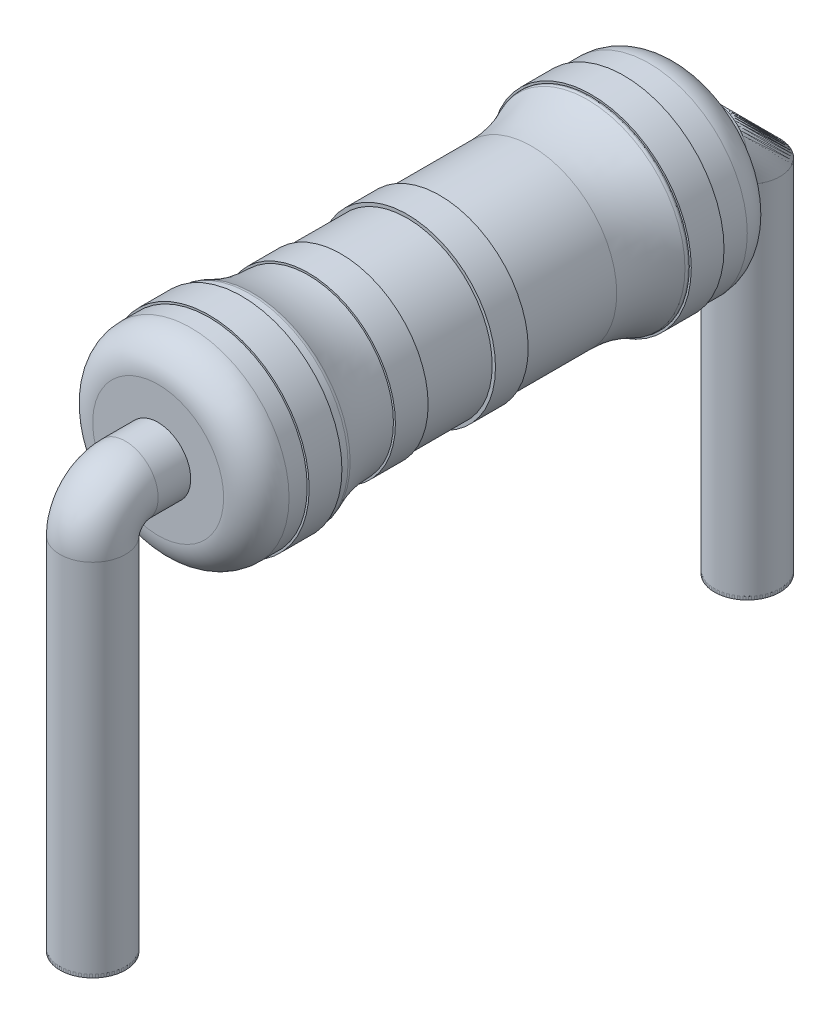
ISO-10303-21;
HEADER;
FILE_DESCRIPTION(('STEP AP214'),'2;1');
FILE_NAME('part.step','',(''),(''),'','','');
FILE_SCHEMA(('AUTOMOTIVE_DESIGN { 1 0 10303 214 1 1 1 1 }'));
ENDSEC;
DATA;
#1=APPLICATION_CONTEXT('core data for automotive mechanical design processes');
#2=APPLICATION_PROTOCOL_DEFINITION('international standard','automotive_design',2000,#1);
#3=PRODUCT_CONTEXT('',#1,'mechanical');
#4=PRODUCT('Part','Part','',(#3));
#5=PRODUCT_RELATED_PRODUCT_CATEGORY('part','',(#4));
#6=PRODUCT_DEFINITION_FORMATION('','',#4);
#7=PRODUCT_DEFINITION_CONTEXT('part definition',#1,'design');
#8=PRODUCT_DEFINITION('design','',#6,#7);
#9=PRODUCT_DEFINITION_SHAPE('','',#8);
#10=(LENGTH_UNIT() NAMED_UNIT(*) SI_UNIT(.MILLI.,.METRE.));
#11=(NAMED_UNIT(*) PLANE_ANGLE_UNIT() SI_UNIT($,.RADIAN.));
#12=(NAMED_UNIT(*) SI_UNIT($,.STERADIAN.) SOLID_ANGLE_UNIT());
#13=UNCERTAINTY_MEASURE_WITH_UNIT(LENGTH_MEASURE(1.E-05),#10,'distance_accuracy_value','');
#14=(GEOMETRIC_REPRESENTATION_CONTEXT(3) GLOBAL_UNCERTAINTY_ASSIGNED_CONTEXT((#13)) GLOBAL_UNIT_ASSIGNED_CONTEXT((#10,
#11,#12)) REPRESENTATION_CONTEXT('',''));
#15=CARTESIAN_POINT('',(0.,0.,0.));
#16=DIRECTION('',(0.,0.,1.));
#17=DIRECTION('',(1.,0.,0.));
#18=AXIS2_PLACEMENT_3D('',#15,#16,#17);
#19=CARTESIAN_POINT('',(0.,-5.95,-5.));
#20=DIRECTION('',(0.,-1.,0.));
#21=DIRECTION('',(0.,0.,-1.));
#22=AXIS2_PLACEMENT_3D('',#19,#20,#21);
#23=CYLINDRICAL_SURFACE('',#22,0.5);
#24=CARTESIAN_POINT('',(0.,-5.95,-5.));
#25=DIRECTION('',(0.,1.,0.));
#26=DIRECTION('',(0.,0.,1.));
#27=AXIS2_PLACEMENT_3D('',#24,#25,#26);
#28=CIRCLE('',#27,0.5);
#29=CARTESIAN_POINT('',(0.,-5.95,-4.5));
#30=VERTEX_POINT('',#29);
#31=EDGE_CURVE('E11',#30,#30,#28,.T.);
#32=ORIENTED_EDGE('',*,*,#31,.F.);
#33=EDGE_LOOP('',(#32));
#34=FACE_BOUND('',#33,.T.);
#35=CARTESIAN_POINT('',(0.,-6.,-5.));
#36=DIRECTION('',(0.,1.,0.));
#37=DIRECTION('',(0.,0.,1.));
#38=AXIS2_PLACEMENT_3D('',#35,#36,#37);
#39=CIRCLE('',#38,0.5);
#40=CARTESIAN_POINT('',(0.,-6.,-4.5));
#41=VERTEX_POINT('',#40);
#42=EDGE_CURVE('E47',#41,#41,#39,.T.);
#43=ORIENTED_EDGE('',*,*,#42,.T.);
#44=EDGE_LOOP('',(#43));
#45=FACE_BOUND('',#44,.T.);
#46=ADVANCED_FACE('F44',(#34,#45),#23,.T.);
#47=CARTESIAN_POINT('',(0.,-5.95,0.));
#48=DIRECTION('',(0.,1.,0.));
#49=DIRECTION('',(0.,0.,1.));
#50=AXIS2_PLACEMENT_3D('',#47,#48,#49);
#51=PLANE('',#50);
#52=ORIENTED_EDGE('',*,*,#31,.T.);
#53=EDGE_LOOP('',(#52));
#54=FACE_BOUND('',#53,.T.);
#55=ADVANCED_FACE('F59',(#54),#51,.T.);
#56=CARTESIAN_POINT('',(0.,-6.,0.));
#57=DIRECTION('',(0.,1.,0.));
#58=DIRECTION('',(0.,0.,1.));
#59=AXIS2_PLACEMENT_3D('',#56,#57,#58);
#60=PLANE('',#59);
#61=ORIENTED_EDGE('',*,*,#42,.F.);
#62=EDGE_LOOP('',(#61));
#63=FACE_BOUND('',#62,.T.);
#64=ADVANCED_FACE('F57',(#63),#60,.F.);
#65=CLOSED_SHELL('',(#46,#55,#64));
#66=MANIFOLD_SOLID_BREP('B2',#65);
#67=CARTESIAN_POINT('',(0.,-5.95,5.));
#68=DIRECTION('',(0.,-1.,0.));
#69=DIRECTION('',(0.,0.,-1.));
#70=AXIS2_PLACEMENT_3D('',#67,#68,#69);
#71=CYLINDRICAL_SURFACE('',#70,0.5);
#72=CARTESIAN_POINT('',(0.,-5.95,5.));
#73=DIRECTION('',(0.,1.,0.));
#74=DIRECTION('',(0.,0.,1.));
#75=AXIS2_PLACEMENT_3D('',#72,#73,#74);
#76=CIRCLE('',#75,0.5);
#77=CARTESIAN_POINT('',(0.,-5.95,5.5));
#78=VERTEX_POINT('',#77);
#79=EDGE_CURVE('E43',#78,#78,#76,.T.);
#80=ORIENTED_EDGE('',*,*,#79,.F.);
#81=EDGE_LOOP('',(#80));
#82=FACE_BOUND('',#81,.T.);
#83=CARTESIAN_POINT('',(0.,-6.,5.));
#84=DIRECTION('',(0.,1.,0.));
#85=DIRECTION('',(0.,0.,1.));
#86=AXIS2_PLACEMENT_3D('',#83,#84,#85);
#87=CIRCLE('',#86,0.5);
#88=CARTESIAN_POINT('',(0.,-6.,5.5));
#89=VERTEX_POINT('',#88);
#90=EDGE_CURVE('E101',#89,#89,#87,.T.);
#91=ORIENTED_EDGE('',*,*,#90,.T.);
#92=EDGE_LOOP('',(#91));
#93=FACE_BOUND('',#92,.T.);
#94=ADVANCED_FACE('F98',(#82,#93),#71,.T.);
#95=CARTESIAN_POINT('',(0.,-5.95,0.));
#96=DIRECTION('',(0.,1.,0.));
#97=DIRECTION('',(0.,0.,1.));
#98=AXIS2_PLACEMENT_3D('',#95,#96,#97);
#99=PLANE('',#98);
#100=ORIENTED_EDGE('',*,*,#79,.T.);
#101=EDGE_LOOP('',(#100));
#102=FACE_BOUND('',#101,.T.);
#103=ADVANCED_FACE('F113',(#102),#99,.T.);
#104=CARTESIAN_POINT('',(0.,-6.,0.));
#105=DIRECTION('',(0.,1.,0.));
#106=DIRECTION('',(0.,0.,1.));
#107=AXIS2_PLACEMENT_3D('',#104,#105,#106);
#108=PLANE('',#107);
#109=ORIENTED_EDGE('',*,*,#90,.F.);
#110=EDGE_LOOP('',(#109));
#111=FACE_BOUND('',#110,.T.);
#112=ADVANCED_FACE('F111',(#111),#108,.F.);
#113=CLOSED_SHELL('',(#94,#103,#112));
#114=MANIFOLD_SOLID_BREP('B6',#113);
#115=CARTESIAN_POINT('',(0.,0.,-4.));
#116=DIRECTION('',(0.,0.,-1.));
#117=DIRECTION('',(-1.,0.,0.));
#118=AXIS2_PLACEMENT_3D('',#115,#116,#117);
#119=CYLINDRICAL_SURFACE('',#118,0.5);
#120=CARTESIAN_POINT('',(0.,0.,-4.));
#121=DIRECTION('',(0.,0.,-1.));
#122=DIRECTION('',(-1.,0.,0.));
#123=AXIS2_PLACEMENT_3D('',#120,#121,#122);
#124=CIRCLE('',#123,0.5);
#125=CARTESIAN_POINT('',(-0.5,0.,-4.));
#126=VERTEX_POINT('',#125);
#127=EDGE_CURVE('E158',#126,#126,#124,.T.);
#128=ORIENTED_EDGE('',*,*,#127,.T.);
#129=EDGE_LOOP('',(#128));
#130=FACE_BOUND('',#129,.T.);
#131=CARTESIAN_POINT('',(0.,0.,-4.5));
#132=DIRECTION('',(0.,0.,-1.));
#133=DIRECTION('',(-1.,0.,0.));
#134=AXIS2_PLACEMENT_3D('',#131,#132,#133);
#135=CIRCLE('',#134,0.5);
#136=CARTESIAN_POINT('',(0.,-0.5,-4.5));
#137=VERTEX_POINT('',#136);
#138=EDGE_CURVE('E96',#137,#137,#135,.T.);
#139=ORIENTED_EDGE('',*,*,#138,.F.);
#140=EDGE_LOOP('',(#139));
#141=FACE_BOUND('',#140,.T.);
#142=ADVANCED_FACE('F152',(#130,#141),#119,.T.);
#143=CARTESIAN_POINT('',(0.,-0.5,-4.5));
#144=DIRECTION('',(-1.,0.,0.));
#145=DIRECTION('',(0.,0.,1.));
#146=AXIS2_PLACEMENT_3D('',#143,#144,#145);
#147=DEGENERATE_TOROIDAL_SURFACE('',#146,0.5,0.5,.T.);
#148=CARTESIAN_POINT('',(0.,-0.5,-5.));
#149=DIRECTION('',(0.,-1.,0.));
#150=DIRECTION('',(-1.,0.,0.));
#151=AXIS2_PLACEMENT_3D('',#148,#149,#150);
#152=CIRCLE('',#151,0.5);
#153=EDGE_CURVE('E163',#137,#137,#152,.T.);
#154=ORIENTED_EDGE('',*,*,#153,.F.);
#155=ORIENTED_EDGE('',*,*,#138,.T.);
#156=EDGE_LOOP('',(#154,#155));
#157=FACE_BOUND('',#156,.T.);
#158=ADVANCED_FACE('F175',(#157),#147,.T.);
#159=CARTESIAN_POINT('',(0.,-0.5,-5.));
#160=DIRECTION('',(0.,-1.,0.));
#161=DIRECTION('',(0.,0.,-1.));
#162=AXIS2_PLACEMENT_3D('',#159,#160,#161);
#163=CYLINDRICAL_SURFACE('',#162,0.5);
#164=ORIENTED_EDGE('',*,*,#153,.T.);
#165=EDGE_LOOP('',(#164));
#166=FACE_BOUND('',#165,.T.);
#167=CARTESIAN_POINT('',(0.,-6.,-5.));
#168=DIRECTION('',(0.,-1.,0.));
#169=DIRECTION('',(-1.,0.,0.));
#170=AXIS2_PLACEMENT_3D('',#167,#168,#169);
#171=CIRCLE('',#170,0.5);
#172=CARTESIAN_POINT('',(-0.5,-6.,-5.));
#173=VERTEX_POINT('',#172);
#174=EDGE_CURVE('E155',#173,#173,#171,.T.);
#175=ORIENTED_EDGE('',*,*,#174,.F.);
#176=EDGE_LOOP('',(#175));
#177=FACE_BOUND('',#176,.T.);
#178=ADVANCED_FACE('F153',(#166,#177),#163,.T.);
#179=OPEN_SHELL('',(#142,#158,#178));
#180=SHELL_BASED_SURFACE_MODEL('B38',(#179));
#181=CARTESIAN_POINT('',(0.,0.,4.00287776352005));
#182=DIRECTION('',(0.,0.,1.));
#183=DIRECTION('',(1.,0.,0.));
#184=AXIS2_PLACEMENT_3D('',#181,#182,#183);
#185=CYLINDRICAL_SURFACE('',#184,0.5);
#186=CARTESIAN_POINT('',(0.,0.,4.00287776352005));
#187=DIRECTION('',(0.,0.,1.));
#188=DIRECTION('',(1.,0.,0.));
#189=AXIS2_PLACEMENT_3D('',#186,#187,#188);
#190=CIRCLE('',#189,0.5);
#191=CARTESIAN_POINT('',(0.5,0.,4.00287776352005));
#192=VERTEX_POINT('',#191);
#193=EDGE_CURVE('E219',#192,#192,#190,.T.);
#194=ORIENTED_EDGE('',*,*,#193,.T.);
#195=EDGE_LOOP('',(#194));
#196=FACE_BOUND('',#195,.T.);
#197=CARTESIAN_POINT('',(0.,0.,4.5));
#198=DIRECTION('',(0.,0.,1.));
#199=DIRECTION('',(1.,0.,0.));
#200=AXIS2_PLACEMENT_3D('',#197,#198,#199);
#201=CIRCLE('',#200,0.5);
#202=CARTESIAN_POINT('',(0.,-0.5,4.5));
#203=VERTEX_POINT('',#202);
#204=EDGE_CURVE('E150',#203,#203,#201,.T.);
#205=ORIENTED_EDGE('',*,*,#204,.F.);
#206=EDGE_LOOP('',(#205));
#207=FACE_BOUND('',#206,.T.);
#208=ADVANCED_FACE('F213',(#196,#207),#185,.T.);
#209=CARTESIAN_POINT('',(0.,-0.5,4.));
#210=DIRECTION('',(0.,-1.,0.));
#211=DIRECTION('',(0.,0.,-1.));
#212=AXIS2_PLACEMENT_3D('',#209,#210,#211);
#213=CIRCLE('',#212,0.5);
#214=TRIMMED_CURVE('',#213,(PARAMETER_VALUE(-3.14159263251637)),
(PARAMETER_VALUE(3.14159263251637)),.T.,.PARAMETER.);
#215=CARTESIAN_POINT('',(0.,-0.5,4.5));
#216=DIRECTION('',(1.,0.,0.));
#217=AXIS1_PLACEMENT('',#215,#216);
#218=SURFACE_OF_REVOLUTION('',#214,#217);
#219=CARTESIAN_POINT('',(0.,-0.500000000000004,5.));
#220=DIRECTION('',(0.,-1.,0.));
#221=DIRECTION('',(1.,0.,0.));
#222=AXIS2_PLACEMENT_3D('',#219,#220,#221);
#223=CIRCLE('',#222,0.5);
#224=EDGE_CURVE('E224',#203,#203,#223,.T.);
#225=ORIENTED_EDGE('',*,*,#224,.F.);
#226=ORIENTED_EDGE('',*,*,#204,.T.);
#227=EDGE_LOOP('',(#225,#226));
#228=FACE_BOUND('',#227,.T.);
#229=ADVANCED_FACE('F236',(#228),#218,.T.);
#230=CARTESIAN_POINT('',(0.,-0.500000000000004,5.));
#231=DIRECTION('',(0.,-1.,0.));
#232=DIRECTION('',(0.,0.,-1.));
#233=AXIS2_PLACEMENT_3D('',#230,#231,#232);
#234=CYLINDRICAL_SURFACE('',#233,0.5);
#235=ORIENTED_EDGE('',*,*,#224,.T.);
#236=EDGE_LOOP('',(#235));
#237=FACE_BOUND('',#236,.T.);
#238=CARTESIAN_POINT('',(0.,-6.,5.));
#239=DIRECTION('',(0.,-1.,0.));
#240=DIRECTION('',(1.,0.,0.));
#241=AXIS2_PLACEMENT_3D('',#238,#239,#240);
#242=CIRCLE('',#241,0.5);
#243=CARTESIAN_POINT('',(0.5,-6.,5.));
#244=VERTEX_POINT('',#243);
#245=EDGE_CURVE('E216',#244,#244,#242,.T.);
#246=ORIENTED_EDGE('',*,*,#245,.F.);
#247=EDGE_LOOP('',(#246));
#248=FACE_BOUND('',#247,.T.);
#249=ADVANCED_FACE('F214',(#237,#248),#234,.T.);
#250=OPEN_SHELL('',(#208,#229,#249));
#251=SHELL_BASED_SURFACE_MODEL('B90',(#250));
#252=CARTESIAN_POINT('',(0.,0.,30.9468802698145));
#253=DIRECTION('',(0.,0.,1.));
#254=DIRECTION('',(1.,0.,0.));
#255=AXIS2_PLACEMENT_3D('',#252,#253,#254);
#256=CYLINDRICAL_SURFACE('',#255,1.5);
#257=CARTESIAN_POINT('',(0.,0.,-2.6));
#258=DIRECTION('',(0.,0.,1.));
#259=DIRECTION('',(1.,0.,0.));
#260=AXIS2_PLACEMENT_3D('',#257,#258,#259);
#261=CIRCLE('',#260,1.5);
#262=CARTESIAN_POINT('',(1.5,0.,-2.6));
#263=VERTEX_POINT('',#262);
#264=EDGE_CURVE('E314',#263,#263,#261,.T.);
#265=ORIENTED_EDGE('',*,*,#264,.F.);
#266=EDGE_LOOP('',(#265));
#267=FACE_BOUND('',#266,.T.);
#268=CARTESIAN_POINT('',(0.,0.,-2.61454960934726));
#269=DIRECTION('',(0.,0.,-1.));
#270=DIRECTION('',(-1.,0.,0.));
#271=AXIS2_PLACEMENT_3D('',#268,#269,#270);
#272=CIRCLE('',#271,1.5);
#273=CARTESIAN_POINT('',(-1.5,0.,-2.61454960934726));
#274=VERTEX_POINT('',#273);
#275=EDGE_CURVE('E212',#274,#274,#272,.T.);
#276=ORIENTED_EDGE('',*,*,#275,.F.);
#277=EDGE_LOOP('',(#276));
#278=FACE_BOUND('',#277,.T.);
#279=ADVANCED_FACE('F267',(#267,#278),#256,.T.);
#280=CARTESIAN_POINT('',(0.,0.,30.9468802698145));
#281=DIRECTION('',(0.,0.,1.));
#282=DIRECTION('',(1.,0.,0.));
#283=AXIS2_PLACEMENT_3D('',#280,#281,#282);
#284=CYLINDRICAL_SURFACE('',#283,1.5);
#285=CARTESIAN_POINT('',(0.,0.,2.6));
#286=DIRECTION('',(0.,0.,1.));
#287=DIRECTION('',(1.,0.,0.));
#288=AXIS2_PLACEMENT_3D('',#285,#286,#287);
#289=CIRCLE('',#288,1.5);
#290=CARTESIAN_POINT('',(1.5,0.,2.6));
#291=VERTEX_POINT('',#290);
#292=EDGE_CURVE('E317',#291,#291,#289,.T.);
#293=ORIENTED_EDGE('',*,*,#292,.T.);
#294=EDGE_LOOP('',(#293));
#295=FACE_BOUND('',#294,.T.);
#296=CARTESIAN_POINT('',(0.,0.,2.7227576675328));
#297=DIRECTION('',(0.,0.,1.));
#298=DIRECTION('',(1.,0.,0.));
#299=AXIS2_PLACEMENT_3D('',#296,#297,#298);
#300=CIRCLE('',#299,1.5);
#301=CARTESIAN_POINT('',(1.5,0.,2.7227576675328));
#302=VERTEX_POINT('',#301);
#303=EDGE_CURVE('E282',#302,#302,#300,.T.);
#304=ORIENTED_EDGE('',*,*,#303,.F.);
#305=EDGE_LOOP('',(#304));
#306=FACE_BOUND('',#305,.T.);
#307=ADVANCED_FACE('F369',(#295,#306),#284,.T.);
#308=CARTESIAN_POINT('',(0.,0.,30.9468802698145));
#309=DIRECTION('',(0.,0.,1.));
#310=DIRECTION('',(1.,0.,0.));
#311=AXIS2_PLACEMENT_3D('',#308,#309,#310);
#312=CYLINDRICAL_SURFACE('',#311,1.3);
#313=CARTESIAN_POINT('',(0.,0.,1.20557280899656));
#314=DIRECTION('',(0.,0.,1.));
#315=DIRECTION('',(1.,0.,0.));
#316=AXIS2_PLACEMENT_3D('',#313,#314,#315);
#317=CIRCLE('',#316,1.3);
#318=CARTESIAN_POINT('',(1.3,0.,1.20557280899656));
#319=VERTEX_POINT('',#318);
#320=EDGE_CURVE('E293',#319,#319,#317,.T.);
#321=ORIENTED_EDGE('',*,*,#320,.F.);
#322=EDGE_LOOP('',(#321));
#323=FACE_BOUND('',#322,.T.);
#324=CARTESIAN_POINT('',(0.,0.,0.196800451709014));
#325=DIRECTION('',(0.,0.,-1.));
#326=DIRECTION('',(-1.,0.,0.));
#327=AXIS2_PLACEMENT_3D('',#324,#325,#326);
#328=CIRCLE('',#327,1.3);
#329=CARTESIAN_POINT('',(-1.3,0.,0.196800451709014));
#330=VERTEX_POINT('',#329);
#331=EDGE_CURVE('E287',#330,#330,#328,.T.);
#332=ORIENTED_EDGE('',*,*,#331,.F.);
#333=EDGE_LOOP('',(#332));
#334=FACE_BOUND('',#333,.T.);
#335=ADVANCED_FACE('F376',(#323,#334),#312,.T.);
#336=CARTESIAN_POINT('',(0.,1.3,1.70557280899656));
#337=DIRECTION('',(0.,0.,-1.));
#338=DIRECTION('',(-1.,0.,0.));
#339=AXIS2_PLACEMENT_3D('',#336,#337,#338);
#340=PLANE('',#339);
#341=CARTESIAN_POINT('',(0.,0.,1.70557280899656));
#342=DIRECTION('',(0.,0.,1.));
#343=DIRECTION('',(1.,0.,0.));
#344=AXIS2_PLACEMENT_3D('',#341,#342,#343);
#345=CIRCLE('',#344,1.3);
#346=CARTESIAN_POINT('',(1.3,0.,1.70557280899656));
#347=VERTEX_POINT('',#346);
#348=EDGE_CURVE('E299',#347,#347,#345,.F.);
#349=ORIENTED_EDGE('',*,*,#348,.T.);
#350=EDGE_LOOP('',(#349));
#351=FACE_BOUND('',#350,.T.);
#352=CARTESIAN_POINT('',(0.,0.,1.70557280899656));
#353=DIRECTION('',(0.,0.,1.));
#354=DIRECTION('',(1.,0.,0.));
#355=AXIS2_PLACEMENT_3D('',#352,#353,#354);
#356=CIRCLE('',#355,1.32999160819457);
#357=CARTESIAN_POINT('',(1.32999160819457,0.,1.70557280899656));
#358=VERTEX_POINT('',#357);
#359=EDGE_CURVE('E326',#358,#358,#356,.T.);
#360=ORIENTED_EDGE('',*,*,#359,.T.);
#361=EDGE_LOOP('',(#360));
#362=FACE_BOUND('',#361,.T.);
#363=ADVANCED_FACE('F454',(#351,#362),#340,.F.);
#364=CARTESIAN_POINT('',(0.,0.,2.18472406688181));
#365=DIRECTION('',(0.,0.,1.));
#366=DIRECTION('',(1.,0.,0.));
#367=AXIS2_PLACEMENT_3D('',#364,#365,#366);
#368=CYLINDRICAL_SURFACE('',#367,1.32999160819457);
#369=ORIENTED_EDGE('',*,*,#359,.F.);
#370=EDGE_LOOP('',(#369));
#371=FACE_BOUND('',#370,.T.);
#372=CARTESIAN_POINT('',(0.,0.,1.20557280899656));
#373=DIRECTION('',(0.,0.,1.));
#374=DIRECTION('',(1.,0.,0.));
#375=AXIS2_PLACEMENT_3D('',#372,#373,#374);
#376=CIRCLE('',#375,1.32999160819457);
#377=CARTESIAN_POINT('',(1.32999160819457,0.,1.20557280899656));
#378=VERTEX_POINT('',#377);
#379=EDGE_CURVE('E329',#378,#378,#376,.T.);
#380=ORIENTED_EDGE('',*,*,#379,.T.);
#381=EDGE_LOOP('',(#380));
#382=FACE_BOUND('',#381,.T.);
#383=ADVANCED_FACE('F450',(#371,#382),#368,.T.);
#384=CARTESIAN_POINT('',(0.,1.3,1.20557280899656));
#385=DIRECTION('',(0.,0.,1.));
#386=DIRECTION('',(1.,0.,0.));
#387=AXIS2_PLACEMENT_3D('',#384,#385,#386);
#388=PLANE('',#387);
#389=ORIENTED_EDGE('',*,*,#379,.F.);
#390=EDGE_LOOP('',(#389));
#391=FACE_BOUND('',#390,.T.);
#392=ORIENTED_EDGE('',*,*,#320,.T.);
#393=EDGE_LOOP('',(#392));
#394=FACE_BOUND('',#393,.T.);
#395=ADVANCED_FACE('F411',(#391,#394),#388,.F.);
#396=CARTESIAN_POINT('',(0.,0.,2.6));
#397=DIRECTION('',(0.,0.,1.));
#398=DIRECTION('',(1.,0.,0.));
#399=AXIS2_PLACEMENT_3D('',#396,#397,#398);
#400=TOROIDAL_SURFACE('',#399,1.4,0.0999999999999999);
#401=CARTESIAN_POINT('',(0.,0.,2.55740822899985));
#402=DIRECTION('',(0.,0.,1.));
#403=DIRECTION('',(1.,0.,0.));
#404=AXIS2_PLACEMENT_3D('',#401,#402,#403);
#405=CIRCLE('',#404,1.49047619047612);
#406=CARTESIAN_POINT('',(1.49047619047612,0.,2.55740822899985));
#407=VERTEX_POINT('',#406);
#408=EDGE_CURVE('E305',#407,#407,#405,.T.);
#409=ORIENTED_EDGE('',*,*,#408,.T.);
#410=EDGE_LOOP('',(#409));
#411=FACE_BOUND('',#410,.T.);
#412=ORIENTED_EDGE('',*,*,#292,.F.);
#413=EDGE_LOOP('',(#412));
#414=FACE_BOUND('',#413,.T.);
#415=ADVANCED_FACE('F402',(#411,#414),#400,.T.);
#416=CARTESIAN_POINT('',(0.,0.,1.70557280899656));
#417=DIRECTION('',(0.,0.,1.));
#418=DIRECTION('',(1.,0.,0.));
#419=AXIS2_PLACEMENT_3D('',#416,#417,#418);
#420=TOROIDAL_SURFACE('',#419,3.29999999999925,2.);
#421=ORIENTED_EDGE('',*,*,#348,.F.);
#422=EDGE_LOOP('',(#421));
#423=FACE_BOUND('',#422,.T.);
#424=ORIENTED_EDGE('',*,*,#408,.F.);
#425=EDGE_LOOP('',(#424));
#426=FACE_BOUND('',#425,.T.);
#427=ADVANCED_FACE('F399',(#423,#426),#420,.F.);
#428=CARTESIAN_POINT('',(0.,1.35,0.196800451709014));
#429=DIRECTION('',(0.,0.,-1.));
#430=DIRECTION('',(-1.,0.,0.));
#431=AXIS2_PLACEMENT_3D('',#428,#429,#430);
#432=PLANE('',#431);
#433=ORIENTED_EDGE('',*,*,#331,.T.);
#434=EDGE_LOOP('',(#433));
#435=FACE_BOUND('',#434,.T.);
#436=CARTESIAN_POINT('',(0.,0.,0.196800451709014));
#437=DIRECTION('',(0.,0.,1.));
#438=DIRECTION('',(1.,0.,0.));
#439=AXIS2_PLACEMENT_3D('',#436,#437,#438);
#440=CIRCLE('',#439,1.35);
#441=CARTESIAN_POINT('',(1.35,0.,0.196800451709014));
#442=VERTEX_POINT('',#441);
#443=EDGE_CURVE('E335',#442,#442,#440,.T.);
#444=ORIENTED_EDGE('',*,*,#443,.T.);
#445=EDGE_LOOP('',(#444));
#446=FACE_BOUND('',#445,.T.);
#447=ADVANCED_FACE('F401',(#435,#446),#432,.F.);
#448=CARTESIAN_POINT('',(0.,1.35,-0.303199548290986));
#449=DIRECTION('',(0.,0.,1.));
#450=DIRECTION('',(1.,0.,0.));
#451=AXIS2_PLACEMENT_3D('',#448,#449,#450);
#452=PLANE('',#451);
#453=CARTESIAN_POINT('',(0.,0.,-0.303199548290986));
#454=DIRECTION('',(0.,0.,1.));
#455=DIRECTION('',(1.,0.,0.));
#456=AXIS2_PLACEMENT_3D('',#453,#454,#455);
#457=CIRCLE('',#456,1.35);
#458=CARTESIAN_POINT('',(1.35,0.,-0.303199548290986));
#459=VERTEX_POINT('',#458);
#460=EDGE_CURVE('E332',#459,#459,#457,.T.);
#461=ORIENTED_EDGE('',*,*,#460,.F.);
#462=EDGE_LOOP('',(#461));
#463=FACE_BOUND('',#462,.T.);
#464=CARTESIAN_POINT('',(0.,0.,-0.303199548290986));
#465=DIRECTION('',(0.,0.,1.));
#466=DIRECTION('',(1.,0.,0.));
#467=AXIS2_PLACEMENT_3D('',#464,#465,#466);
#468=CIRCLE('',#467,1.3);
#469=CARTESIAN_POINT('',(1.3,0.,-0.303199548290986));
#470=VERTEX_POINT('',#469);
#471=EDGE_CURVE('E290',#470,#470,#468,.T.);
#472=ORIENTED_EDGE('',*,*,#471,.T.);
#473=EDGE_LOOP('',(#472));
#474=FACE_BOUND('',#473,.T.);
#475=ADVANCED_FACE('F408',(#463,#474),#452,.F.);
#476=CARTESIAN_POINT('',(0.,0.,0.489395269526655));
#477=DIRECTION('',(0.,0.,1.));
#478=DIRECTION('',(1.,0.,0.));
#479=AXIS2_PLACEMENT_3D('',#476,#477,#478);
#480=CYLINDRICAL_SURFACE('',#479,1.35);
#481=ORIENTED_EDGE('',*,*,#443,.F.);
#482=EDGE_LOOP('',(#481));
#483=FACE_BOUND('',#482,.T.);
#484=ORIENTED_EDGE('',*,*,#460,.T.);
#485=EDGE_LOOP('',(#484));
#486=FACE_BOUND('',#485,.T.);
#487=ADVANCED_FACE('F440',(#483,#486),#480,.T.);
#488=CARTESIAN_POINT('',(0.,0.,-2.6));
#489=DIRECTION('',(0.,0.,1.));
#490=DIRECTION('',(1.,0.,0.));
#491=AXIS2_PLACEMENT_3D('',#488,#489,#490);
#492=TOROIDAL_SURFACE('',#491,1.4,0.0999999999999998);
#493=CARTESIAN_POINT('',(0.,0.,-2.55740822899985));
#494=DIRECTION('',(0.,0.,-1.));
#495=DIRECTION('',(-1.,0.,0.));
#496=AXIS2_PLACEMENT_3D('',#493,#494,#495);
#497=CIRCLE('',#496,1.49047619047612);
#498=CARTESIAN_POINT('',(-1.49047619047612,0.,-2.55740822899985));
#499=VERTEX_POINT('',#498);
#500=EDGE_CURVE('E296',#499,#499,#497,.T.);
#501=ORIENTED_EDGE('',*,*,#500,.T.);
#502=EDGE_LOOP('',(#501));
#503=FACE_BOUND('',#502,.T.);
#504=ORIENTED_EDGE('',*,*,#264,.T.);
#505=EDGE_LOOP('',(#504));
#506=FACE_BOUND('',#505,.T.);
#507=ADVANCED_FACE('F443',(#503,#506),#492,.T.);
#508=CARTESIAN_POINT('',(0.,0.,-1.70557280899656));
#509=DIRECTION('',(0.,0.,1.));
#510=DIRECTION('',(1.,0.,0.));
#511=AXIS2_PLACEMENT_3D('',#508,#509,#510);
#512=TOROIDAL_SURFACE('',#511,3.29999999999925,2.);
#513=ORIENTED_EDGE('',*,*,#500,.F.);
#514=EDGE_LOOP('',(#513));
#515=FACE_BOUND('',#514,.T.);
#516=CARTESIAN_POINT('',(0.,0.,-1.70557280899657));
#517=DIRECTION('',(0.,0.,1.));
#518=DIRECTION('',(1.,0.,0.));
#519=AXIS2_PLACEMENT_3D('',#516,#517,#518);
#520=CIRCLE('',#519,1.3);
#521=CARTESIAN_POINT('',(1.3,0.,-1.70557280899657));
#522=VERTEX_POINT('',#521);
#523=EDGE_CURVE('E302',#522,#522,#520,.T.);
#524=ORIENTED_EDGE('',*,*,#523,.F.);
#525=EDGE_LOOP('',(#524));
#526=FACE_BOUND('',#525,.T.);
#527=ADVANCED_FACE('F269',(#515,#526),#512,.F.);
#528=ORIENTED_EDGE('',*,*,#523,.T.);
#529=EDGE_LOOP('',(#528));
#530=FACE_BOUND('',#529,.T.);
#531=ORIENTED_EDGE('',*,*,#471,.F.);
#532=EDGE_LOOP('',(#531));
#533=FACE_BOUND('',#532,.T.);
#534=ADVANCED_FACE('F435',(#530,#533),#312,.T.);
#535=CARTESIAN_POINT('',(0.,1.53,3.2227576675328));
#536=DIRECTION('',(0.,0.,-1.));
#537=DIRECTION('',(-1.,0.,0.));
#538=AXIS2_PLACEMENT_3D('',#535,#536,#537);
#539=PLANE('',#538);
#540=CARTESIAN_POINT('',(0.,0.,3.2227576675328));
#541=DIRECTION('',(0.,0.,-1.));
#542=DIRECTION('',(-1.,0.,0.));
#543=AXIS2_PLACEMENT_3D('',#540,#541,#542);
#544=CIRCLE('',#543,1.5);
#545=CARTESIAN_POINT('',(-1.5,0.,3.2227576675328));
#546=VERTEX_POINT('',#545);
#547=EDGE_CURVE('E278',#546,#546,#544,.T.);
#548=ORIENTED_EDGE('',*,*,#547,.T.);
#549=EDGE_LOOP('',(#548));
#550=FACE_BOUND('',#549,.T.);
#551=CARTESIAN_POINT('',(0.,0.,3.2227576675328));
#552=DIRECTION('',(0.,0.,1.));
#553=DIRECTION('',(1.,0.,0.));
#554=AXIS2_PLACEMENT_3D('',#551,#552,#553);
#555=CIRCLE('',#554,1.53);
#556=CARTESIAN_POINT('',(1.53,0.,3.2227576675328));
#557=VERTEX_POINT('',#556);
#558=EDGE_CURVE('E341',#557,#557,#555,.T.);
#559=ORIENTED_EDGE('',*,*,#558,.T.);
#560=EDGE_LOOP('',(#559));
#561=FACE_BOUND('',#560,.T.);
#562=ADVANCED_FACE('F425',(#550,#561),#539,.F.);
#563=CARTESIAN_POINT('',(0.,1.53,2.7227576675328));
#564=DIRECTION('',(0.,0.,1.));
#565=DIRECTION('',(1.,0.,0.));
#566=AXIS2_PLACEMENT_3D('',#563,#564,#565);
#567=PLANE('',#566);
#568=CARTESIAN_POINT('',(0.,0.,2.7227576675328));
#569=DIRECTION('',(0.,0.,1.));
#570=DIRECTION('',(1.,0.,0.));
#571=AXIS2_PLACEMENT_3D('',#568,#569,#570);
#572=CIRCLE('',#571,1.53);
#573=CARTESIAN_POINT('',(1.53,0.,2.7227576675328));
#574=VERTEX_POINT('',#573);
#575=EDGE_CURVE('E338',#574,#574,#572,.T.);
#576=ORIENTED_EDGE('',*,*,#575,.F.);
#577=EDGE_LOOP('',(#576));
#578=FACE_BOUND('',#577,.T.);
#579=ORIENTED_EDGE('',*,*,#303,.T.);
#580=EDGE_LOOP('',(#579));
#581=FACE_BOUND('',#580,.T.);
#582=ADVANCED_FACE('F422',(#578,#581),#567,.F.);
#583=CARTESIAN_POINT('',(0.,0.,0.449237837598222));
#584=DIRECTION('',(0.,0.,1.));
#585=DIRECTION('',(1.,0.,0.));
#586=AXIS2_PLACEMENT_3D('',#583,#584,#585);
#587=CYLINDRICAL_SURFACE('',#586,1.53);
#588=ORIENTED_EDGE('',*,*,#558,.F.);
#589=EDGE_LOOP('',(#588));
#590=FACE_BOUND('',#589,.T.);
#591=ORIENTED_EDGE('',*,*,#575,.T.);
#592=EDGE_LOOP('',(#591));
#593=FACE_BOUND('',#592,.T.);
#594=ADVANCED_FACE('F424',(#590,#593),#587,.T.);
#595=CARTESIAN_POINT('',(0.,1.,4.));
#596=DIRECTION('',(0.,0.,-1.));
#597=DIRECTION('',(-1.,0.,0.));
#598=AXIS2_PLACEMENT_3D('',#595,#596,#597);
#599=PLANE('',#598);
#600=CARTESIAN_POINT('',(0.,0.,4.));
#601=DIRECTION('',(0.,0.,1.));
#602=DIRECTION('',(1.,0.,0.));
#603=AXIS2_PLACEMENT_3D('',#600,#601,#602);
#604=CIRCLE('',#603,1.);
#605=CARTESIAN_POINT('',(1.,0.,4.));
#606=VERTEX_POINT('',#605);
#607=EDGE_CURVE('E323',#606,#606,#604,.T.);
#608=ORIENTED_EDGE('',*,*,#607,.T.);
#609=EDGE_LOOP('',(#608));
#610=FACE_BOUND('',#609,.T.);
#611=ADVANCED_FACE('F432',(#610),#599,.F.);
#612=CARTESIAN_POINT('',(0.,0.,3.5));
#613=DIRECTION('',(0.,0.,1.));
#614=DIRECTION('',(1.,0.,0.));
#615=AXIS2_PLACEMENT_3D('',#612,#613,#614);
#616=TOROIDAL_SURFACE('',#615,1.,0.5);
#617=ORIENTED_EDGE('',*,*,#607,.F.);
#618=EDGE_LOOP('',(#617));
#619=FACE_BOUND('',#618,.T.);
#620=CARTESIAN_POINT('',(0.,0.,3.5));
#621=DIRECTION('',(0.,0.,1.));
#622=DIRECTION('',(1.,0.,0.));
#623=AXIS2_PLACEMENT_3D('',#620,#621,#622);
#624=CIRCLE('',#623,1.5);
#625=CARTESIAN_POINT('',(1.5,0.,3.5));
#626=VERTEX_POINT('',#625);
#627=EDGE_CURVE('E320',#626,#626,#624,.T.);
#628=ORIENTED_EDGE('',*,*,#627,.T.);
#629=EDGE_LOOP('',(#628));
#630=FACE_BOUND('',#629,.T.);
#631=ADVANCED_FACE('F461',(#619,#630),#616,.T.);
#632=ORIENTED_EDGE('',*,*,#627,.F.);
#633=EDGE_LOOP('',(#632));
#634=FACE_BOUND('',#633,.T.);
#635=ORIENTED_EDGE('',*,*,#547,.F.);
#636=EDGE_LOOP('',(#635));
#637=FACE_BOUND('',#636,.T.);
#638=ADVANCED_FACE('F366',(#634,#637),#284,.T.);
#639=CARTESIAN_POINT('',(0.,1.53,-2.61454960934726));
#640=DIRECTION('',(0.,0.,-1.));
#641=DIRECTION('',(-1.,0.,0.));
#642=AXIS2_PLACEMENT_3D('',#639,#640,#641);
#643=PLANE('',#642);
#644=ORIENTED_EDGE('',*,*,#275,.T.);
#645=EDGE_LOOP('',(#644));
#646=FACE_BOUND('',#645,.T.);
#647=CARTESIAN_POINT('',(0.,0.,-2.61454960934726));
#648=DIRECTION('',(0.,0.,1.));
#649=DIRECTION('',(1.,0.,0.));
#650=AXIS2_PLACEMENT_3D('',#647,#648,#649);
#651=CIRCLE('',#650,1.53);
#652=CARTESIAN_POINT('',(1.53,0.,-2.61454960934726));
#653=VERTEX_POINT('',#652);
#654=EDGE_CURVE('E347',#653,#653,#651,.T.);
#655=ORIENTED_EDGE('',*,*,#654,.T.);
#656=EDGE_LOOP('',(#655));
#657=FACE_BOUND('',#656,.T.);
#658=ADVANCED_FACE('F351',(#646,#657),#643,.F.);
#659=CARTESIAN_POINT('',(0.,1.53,-3.11454960934726));
#660=DIRECTION('',(0.,0.,1.));
#661=DIRECTION('',(1.,0.,0.));
#662=AXIS2_PLACEMENT_3D('',#659,#660,#661);
#663=PLANE('',#662);
#664=CARTESIAN_POINT('',(0.,0.,-3.11454960934726));
#665=DIRECTION('',(0.,0.,1.));
#666=DIRECTION('',(1.,0.,0.));
#667=AXIS2_PLACEMENT_3D('',#664,#665,#666);
#668=CIRCLE('',#667,1.53);
#669=CARTESIAN_POINT('',(1.53,0.,-3.11454960934726));
#670=VERTEX_POINT('',#669);
#671=EDGE_CURVE('E344',#670,#670,#668,.T.);
#672=ORIENTED_EDGE('',*,*,#671,.F.);
#673=EDGE_LOOP('',(#672));
#674=FACE_BOUND('',#673,.T.);
#675=CARTESIAN_POINT('',(0.,0.,-3.11454960934726));
#676=DIRECTION('',(0.,0.,1.));
#677=DIRECTION('',(1.,0.,0.));
#678=AXIS2_PLACEMENT_3D('',#675,#676,#677);
#679=CIRCLE('',#678,1.5);
#680=CARTESIAN_POINT('',(1.5,0.,-3.11454960934726));
#681=VERTEX_POINT('',#680);
#682=EDGE_CURVE('E274',#681,#681,#679,.T.);
#683=ORIENTED_EDGE('',*,*,#682,.T.);
#684=EDGE_LOOP('',(#683));
#685=FACE_BOUND('',#684,.T.);
#686=ADVANCED_FACE('F357',(#674,#685),#663,.F.);
#687=CARTESIAN_POINT('',(0.,0.,0.313399994482615));
#688=DIRECTION('',(0.,0.,1.));
#689=DIRECTION('',(1.,0.,0.));
#690=AXIS2_PLACEMENT_3D('',#687,#688,#689);
#691=CYLINDRICAL_SURFACE('',#690,1.53);
#692=ORIENTED_EDGE('',*,*,#654,.F.);
#693=EDGE_LOOP('',(#692));
#694=FACE_BOUND('',#693,.T.);
#695=ORIENTED_EDGE('',*,*,#671,.T.);
#696=EDGE_LOOP('',(#695));
#697=FACE_BOUND('',#696,.T.);
#698=ADVANCED_FACE('F353',(#694,#697),#691,.T.);
#699=CARTESIAN_POINT('',(0.,1.,-4.));
#700=DIRECTION('',(0.,0.,1.));
#701=DIRECTION('',(1.,0.,0.));
#702=AXIS2_PLACEMENT_3D('',#699,#700,#701);
#703=PLANE('',#702);
#704=CARTESIAN_POINT('',(0.,0.,-4.));
#705=DIRECTION('',(0.,0.,1.));
#706=DIRECTION('',(1.,0.,0.));
#707=AXIS2_PLACEMENT_3D('',#704,#705,#706);
#708=CIRCLE('',#707,1.);
#709=CARTESIAN_POINT('',(1.,0.,-4.));
#710=VERTEX_POINT('',#709);
#711=EDGE_CURVE('E308',#710,#710,#708,.T.);
#712=ORIENTED_EDGE('',*,*,#711,.F.);
#713=EDGE_LOOP('',(#712));
#714=FACE_BOUND('',#713,.T.);
#715=ADVANCED_FACE('F356',(#714),#703,.F.);
#716=CARTESIAN_POINT('',(0.,0.,-3.5));
#717=DIRECTION('',(0.,0.,1.));
#718=DIRECTION('',(1.,0.,0.));
#719=AXIS2_PLACEMENT_3D('',#716,#717,#718);
#720=TOROIDAL_SURFACE('',#719,1.,0.5);
#721=CARTESIAN_POINT('',(0.,0.,-3.5));
#722=DIRECTION('',(0.,0.,1.));
#723=DIRECTION('',(1.,0.,0.));
#724=AXIS2_PLACEMENT_3D('',#721,#722,#723);
#725=CIRCLE('',#724,1.5);
#726=CARTESIAN_POINT('',(1.5,0.,-3.5));
#727=VERTEX_POINT('',#726);
#728=EDGE_CURVE('E311',#727,#727,#725,.T.);
#729=ORIENTED_EDGE('',*,*,#728,.F.);
#730=EDGE_LOOP('',(#729));
#731=FACE_BOUND('',#730,.T.);
#732=ORIENTED_EDGE('',*,*,#711,.T.);
#733=EDGE_LOOP('',(#732));
#734=FACE_BOUND('',#733,.T.);
#735=ADVANCED_FACE('F384',(#731,#734),#720,.T.);
#736=ORIENTED_EDGE('',*,*,#728,.T.);
#737=EDGE_LOOP('',(#736));
#738=FACE_BOUND('',#737,.T.);
#739=ORIENTED_EDGE('',*,*,#682,.F.);
#740=EDGE_LOOP('',(#739));
#741=FACE_BOUND('',#740,.T.);
#742=ADVANCED_FACE('F372',(#738,#741),#256,.T.);
#743=CLOSED_SHELL('',(#279,#307,#335,#363,#383,#395,#415,#427,#447,#475,#487,#507,#527,#534,
#562,#582,#594,#611,#631,#638,#658,#686,#698,#715,#735,#742));
#744=MANIFOLD_SOLID_BREP('B144',#743);
#745=ADVANCED_BREP_SHAPE_REPRESENTATION('',(#18,#66,#114,#744),#14);
#746=MANIFOLD_SURFACE_SHAPE_REPRESENTATION('',(#18,#180,#251),#14);
#747=SHAPE_REPRESENTATION('',(#18),#14);
#748=SHAPE_DEFINITION_REPRESENTATION(#9,#747);
#749=SHAPE_REPRESENTATION_RELATIONSHIP('','',#747,#745);
#750=SHAPE_REPRESENTATION_RELATIONSHIP('','',#747,#746);
ENDSEC;
END-ISO-10303-21;
